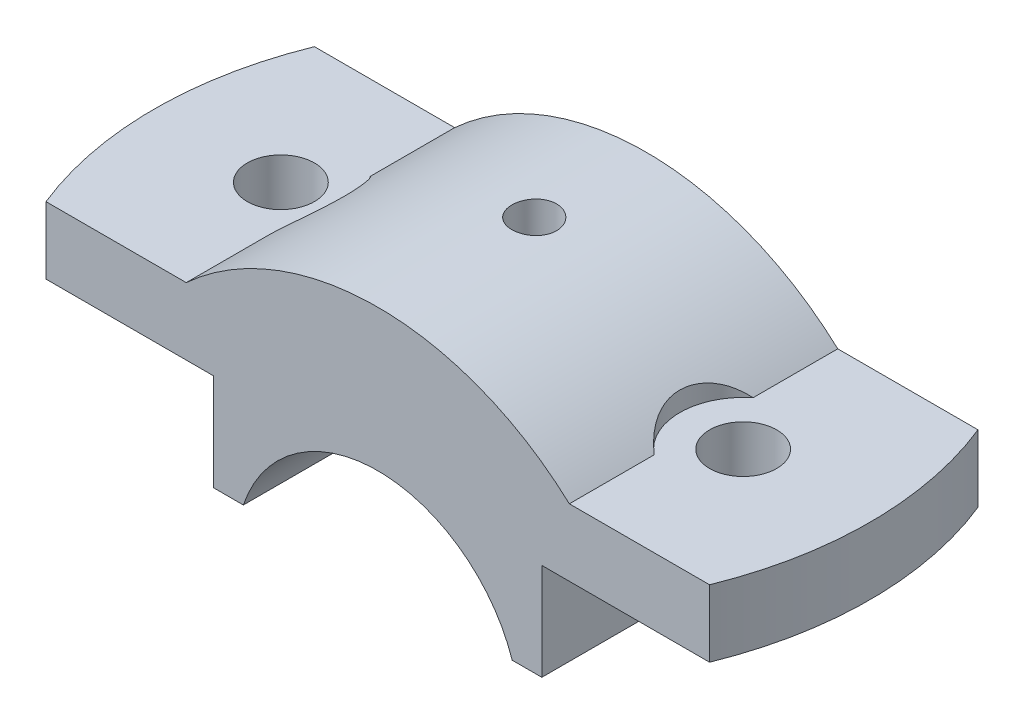
ISO-10303-21;
HEADER;
FILE_DESCRIPTION(('STEP AP214'),'2;1');
FILE_NAME('part.step','',(''),(''),'','','');
FILE_SCHEMA(('AUTOMOTIVE_DESIGN { 1 0 10303 214 1 1 1 1 }'));
ENDSEC;
DATA;
#1=APPLICATION_CONTEXT('core data for automotive mechanical design processes');
#2=APPLICATION_PROTOCOL_DEFINITION('international standard','automotive_design',2000,#1);
#3=PRODUCT_CONTEXT('',#1,'mechanical');
#4=PRODUCT('Part','Part','',(#3));
#5=PRODUCT_RELATED_PRODUCT_CATEGORY('part','',(#4));
#6=PRODUCT_DEFINITION_FORMATION('','',#4);
#7=PRODUCT_DEFINITION_CONTEXT('part definition',#1,'design');
#8=PRODUCT_DEFINITION('design','',#6,#7);
#9=PRODUCT_DEFINITION_SHAPE('','',#8);
#10=(LENGTH_UNIT() NAMED_UNIT(*) SI_UNIT(.MILLI.,.METRE.));
#11=(NAMED_UNIT(*) PLANE_ANGLE_UNIT() SI_UNIT($,.RADIAN.));
#12=(NAMED_UNIT(*) SI_UNIT($,.STERADIAN.) SOLID_ANGLE_UNIT());
#13=UNCERTAINTY_MEASURE_WITH_UNIT(LENGTH_MEASURE(1.E-05),#10,'distance_accuracy_value','');
#14=(GEOMETRIC_REPRESENTATION_CONTEXT(3) GLOBAL_UNCERTAINTY_ASSIGNED_CONTEXT((#13)) GLOBAL_UNIT_ASSIGNED_CONTEXT((#10,
#11,#12)) REPRESENTATION_CONTEXT('',''));
#15=CARTESIAN_POINT('',(0.,0.,0.));
#16=DIRECTION('',(0.,0.,1.));
#17=DIRECTION('',(1.,0.,0.));
#18=AXIS2_PLACEMENT_3D('',#15,#16,#17);
#19=CARTESIAN_POINT('',(22.,19.,18.));
#20=DIRECTION('',(0.,1.,0.));
#21=DIRECTION('',(0.,0.,1.));
#22=AXIS2_PLACEMENT_3D('',#19,#20,#21);
#23=PLANE('',#22);
#24=CARTESIAN_POINT('',(31.,19.,0.));
#25=DIRECTION('',(0.,1.,0.));
#26=DIRECTION('',(0.,0.,1.));
#27=AXIS2_PLACEMENT_3D('',#24,#25,#26);
#28=CIRCLE('',#27,4.49999999999999);
#29=CARTESIAN_POINT('',(31.,19.,4.49999999999999));
#30=VERTEX_POINT('',#29);
#31=EDGE_CURVE('E487',#30,#30,#28,.T.);
#32=ORIENTED_EDGE('',*,*,#31,.T.);
#33=EDGE_LOOP('',(#32));
#34=FACE_BOUND('',#33,.T.);
#35=CARTESIAN_POINT('',(0.,19.,0.));
#36=DIRECTION('',(0.,1.,0.));
#37=DIRECTION('',(0.,0.,1.));
#38=AXIS2_PLACEMENT_3D('',#35,#36,#37);
#39=CIRCLE('',#38,48.);
#40=CARTESIAN_POINT('',(44.497190922574,19.,18.));
#41=VERTEX_POINT('',#40);
#42=CARTESIAN_POINT('',(44.497190922574,19.,-18.));
#43=VERTEX_POINT('',#42);
#44=EDGE_CURVE('E61',#41,#43,#39,.T.);
#45=ORIENTED_EDGE('',*,*,#44,.F.);
#46=DIRECTION('',(1.,0.,0.));
#47=VECTOR('',#46,1.);
#48=CARTESIAN_POINT('',(22.,19.,18.));
#49=LINE('',#48,#47);
#50=CARTESIAN_POINT('',(22.,19.,18.));
#51=VERTEX_POINT('',#50);
#52=EDGE_CURVE('E310',#51,#41,#49,.T.);
#53=ORIENTED_EDGE('',*,*,#52,.F.);
#54=DIRECTION('',(0.,0.,-1.));
#55=VECTOR('',#54,1.);
#56=CARTESIAN_POINT('',(22.,19.,18.));
#57=LINE('',#56,#55);
#58=CARTESIAN_POINT('',(22.,19.,-18.));
#59=VERTEX_POINT('',#58);
#60=EDGE_CURVE('E156',#51,#59,#57,.T.);
#61=ORIENTED_EDGE('',*,*,#60,.T.);
#62=DIRECTION('',(1.,0.,0.));
#63=VECTOR('',#62,1.);
#64=CARTESIAN_POINT('',(22.,19.,-18.));
#65=LINE('',#64,#63);
#66=EDGE_CURVE('E254',#59,#43,#65,.T.);
#67=ORIENTED_EDGE('',*,*,#66,.T.);
#68=EDGE_LOOP('',(#45,#53,#61,#67));
#69=FACE_BOUND('',#68,.T.);
#70=ADVANCED_FACE('F32',(#34,#69),#23,.F.);
#71=CARTESIAN_POINT('',(50.,28.,18.));
#72=DIRECTION('',(0.,-1.,0.));
#73=DIRECTION('',(1.,0.,0.));
#74=AXIS2_PLACEMENT_3D('',#71,#72,#73);
#75=PLANE('',#74);
#76=CARTESIAN_POINT('',(31.,28.,0.));
#77=DIRECTION('',(0.,1.,0.));
#78=DIRECTION('',(0.,0.,1.));
#79=AXIS2_PLACEMENT_3D('',#76,#77,#78);
#80=CIRCLE('',#79,4.49999999999999);
#81=CARTESIAN_POINT('',(31.,28.,4.49999999999999));
#82=VERTEX_POINT('',#81);
#83=EDGE_CURVE('E140',#82,#82,#80,.T.);
#84=ORIENTED_EDGE('',*,*,#83,.F.);
#85=EDGE_LOOP('',(#84));
#86=FACE_BOUND('',#85,.T.);
#87=CARTESIAN_POINT('',(0.,28.,0.));
#88=DIRECTION('',(0.,1.,0.));
#89=DIRECTION('',(1.,0.,0.));
#90=AXIS2_PLACEMENT_3D('',#87,#88,#89);
#91=CIRCLE('',#90,48.);
#92=CARTESIAN_POINT('',(44.497190922574,28.,18.));
#93=VERTEX_POINT('',#92);
#94=CARTESIAN_POINT('',(44.497190922574,28.,-18.));
#95=VERTEX_POINT('',#94);
#96=EDGE_CURVE('E488',#93,#95,#91,.T.);
#97=ORIENTED_EDGE('',*,*,#96,.T.);
#98=DIRECTION('',(-1.,0.,0.));
#99=VECTOR('',#98,1.);
#100=CARTESIAN_POINT('',(50.,28.,-18.));
#101=LINE('',#100,#99);
#102=CARTESIAN_POINT('',(25.6904651573303,28.,-18.));
#103=VERTEX_POINT('',#102);
#104=EDGE_CURVE('E152',#95,#103,#101,.T.);
#105=ORIENTED_EDGE('',*,*,#104,.T.);
#106=DIRECTION('',(0.,0.,-1.));
#107=VECTOR('',#106,1.);
#108=CARTESIAN_POINT('',(25.6904651573303,28.,18.));
#109=LINE('',#108,#107);
#110=CARTESIAN_POINT('',(25.6904651573303,28.,-6.63768331230679));
#111=VERTEX_POINT('',#110);
#112=EDGE_CURVE('E145',#111,#103,#109,.T.);
#113=ORIENTED_EDGE('',*,*,#112,.F.);
#114=CARTESIAN_POINT('',(31.,28.,0.));
#115=DIRECTION('',(0.,-1.,0.));
#116=DIRECTION('',(1.,0.,0.));
#117=AXIS2_PLACEMENT_3D('',#114,#115,#116);
#118=CIRCLE('',#117,8.5);
#119=CARTESIAN_POINT('',(25.6904651573303,28.,6.63768331230678));
#120=VERTEX_POINT('',#119);
#121=EDGE_CURVE('E53',#120,#111,#118,.T.);
#122=ORIENTED_EDGE('',*,*,#121,.F.);
#123=CARTESIAN_POINT('',(25.6904651573303,28.,18.));
#124=VERTEX_POINT('',#123);
#125=EDGE_CURVE('E148',#124,#120,#109,.T.);
#126=ORIENTED_EDGE('',*,*,#125,.F.);
#127=DIRECTION('',(-1.,0.,0.));
#128=VECTOR('',#127,1.);
#129=CARTESIAN_POINT('',(50.,28.,18.));
#130=LINE('',#129,#128);
#131=EDGE_CURVE('E313',#93,#124,#130,.T.);
#132=ORIENTED_EDGE('',*,*,#131,.F.);
#133=EDGE_LOOP('',(#97,#105,#113,#122,#126,#132));
#134=FACE_BOUND('',#133,.T.);
#135=ADVANCED_FACE('F150',(#86,#134),#75,.F.);
#136=CARTESIAN_POINT('',(0.,0.,18.));
#137=DIRECTION('',(0.,0.,1.));
#138=DIRECTION('',(1.,0.,0.));
#139=AXIS2_PLACEMENT_3D('',#136,#137,#138);
#140=PLANE('',#139);
#141=ORIENTED_EDGE('',*,*,#52,.T.);
#142=DIRECTION('',(0.,1.,0.));
#143=VECTOR('',#142,1.);
#144=CARTESIAN_POINT('',(44.497190922574,5.99999999999998,18.));
#145=LINE('',#144,#143);
#146=EDGE_CURVE('E490',#41,#93,#145,.T.);
#147=ORIENTED_EDGE('',*,*,#146,.T.);
#148=ORIENTED_EDGE('',*,*,#131,.T.);
#149=CARTESIAN_POINT('',(0.,0.,18.));
#150=DIRECTION('',(0.,0.,1.));
#151=DIRECTION('',(1.,0.,0.));
#152=AXIS2_PLACEMENT_3D('',#149,#150,#151);
#153=CIRCLE('',#152,38.);
#154=CARTESIAN_POINT('',(-25.6904651573303,28.,18.));
#155=VERTEX_POINT('',#154);
#156=EDGE_CURVE('E315',#124,#155,#153,.T.);
#157=ORIENTED_EDGE('',*,*,#156,.T.);
#158=DIRECTION('',(-1.,0.,0.));
#159=VECTOR('',#158,1.);
#160=CARTESIAN_POINT('',(-50.,28.,18.));
#161=LINE('',#160,#159);
#162=CARTESIAN_POINT('',(-44.497190922574,28.,18.));
#163=VERTEX_POINT('',#162);
#164=EDGE_CURVE('E317',#155,#163,#161,.T.);
#165=ORIENTED_EDGE('',*,*,#164,.T.);
#166=DIRECTION('',(0.,1.,0.));
#167=VECTOR('',#166,1.);
#168=CARTESIAN_POINT('',(-44.497190922574,5.99999999999998,18.));
#169=LINE('',#168,#167);
#170=CARTESIAN_POINT('',(-44.497190922574,19.,18.));
#171=VERTEX_POINT('',#170);
#172=EDGE_CURVE('E300',#171,#163,#169,.T.);
#173=ORIENTED_EDGE('',*,*,#172,.F.);
#174=DIRECTION('',(1.,0.,0.));
#175=VECTOR('',#174,1.);
#176=CARTESIAN_POINT('',(-22.,19.,18.));
#177=LINE('',#176,#175);
#178=CARTESIAN_POINT('',(-22.,19.,18.));
#179=VERTEX_POINT('',#178);
#180=EDGE_CURVE('E299',#171,#179,#177,.T.);
#181=ORIENTED_EDGE('',*,*,#180,.T.);
#182=DIRECTION('',(0.,-1.,0.));
#183=VECTOR('',#182,1.);
#184=CARTESIAN_POINT('',(-22.,6.,18.));
#185=LINE('',#184,#183);
#186=CARTESIAN_POINT('',(-22.,6.,18.));
#187=VERTEX_POINT('',#186);
#188=EDGE_CURVE('E321',#179,#187,#185,.T.);
#189=ORIENTED_EDGE('',*,*,#188,.T.);
#190=DIRECTION('',(1.,0.,0.));
#191=VECTOR('',#190,1.);
#192=CARTESIAN_POINT('',(-18.0277563773199,6.,18.));
#193=LINE('',#192,#191);
#194=CARTESIAN_POINT('',(-18.0277563773199,6.,18.));
#195=VERTEX_POINT('',#194);
#196=EDGE_CURVE('E276',#187,#195,#193,.T.);
#197=ORIENTED_EDGE('',*,*,#196,.T.);
#198=CARTESIAN_POINT('',(0.,0.,18.));
#199=DIRECTION('',(0.,0.,-1.));
#200=DIRECTION('',(1.,0.,0.));
#201=AXIS2_PLACEMENT_3D('',#198,#199,#200);
#202=CIRCLE('',#201,19.);
#203=CARTESIAN_POINT('',(18.0277563773199,6.,18.));
#204=VERTEX_POINT('',#203);
#205=EDGE_CURVE('E271',#195,#204,#202,.T.);
#206=ORIENTED_EDGE('',*,*,#205,.T.);
#207=DIRECTION('',(1.,0.,0.));
#208=VECTOR('',#207,1.);
#209=CARTESIAN_POINT('',(18.0277563773199,6.,18.));
#210=LINE('',#209,#208);
#211=CARTESIAN_POINT('',(22.,6.,18.));
#212=VERTEX_POINT('',#211);
#213=EDGE_CURVE('E307',#204,#212,#210,.T.);
#214=ORIENTED_EDGE('',*,*,#213,.T.);
#215=DIRECTION('',(0.,1.,0.));
#216=VECTOR('',#215,1.);
#217=CARTESIAN_POINT('',(22.,6.,18.));
#218=LINE('',#217,#216);
#219=EDGE_CURVE('E251',#212,#51,#218,.T.);
#220=ORIENTED_EDGE('',*,*,#219,.T.);
#221=EDGE_LOOP('',(#141,#147,#148,#157,#165,#173,#181,#189,#197,#206,#214,#220));
#222=FACE_BOUND('',#221,.T.);
#223=ADVANCED_FACE('F224',(#222),#140,.T.);
#224=CARTESIAN_POINT('',(0.,0.,-18.));
#225=DIRECTION('',(0.,0.,1.));
#226=DIRECTION('',(1.,0.,0.));
#227=AXIS2_PLACEMENT_3D('',#224,#225,#226);
#228=PLANE('',#227);
#229=DIRECTION('',(0.,1.,0.));
#230=VECTOR('',#229,1.);
#231=CARTESIAN_POINT('',(44.497190922574,5.99999999999999,-18.));
#232=LINE('',#231,#230);
#233=EDGE_CURVE('E46',#43,#95,#232,.T.);
#234=ORIENTED_EDGE('',*,*,#233,.F.);
#235=ORIENTED_EDGE('',*,*,#66,.F.);
#236=DIRECTION('',(0.,1.,0.));
#237=VECTOR('',#236,1.);
#238=CARTESIAN_POINT('',(22.,6.,-18.));
#239=LINE('',#238,#237);
#240=CARTESIAN_POINT('',(22.,6.,-18.));
#241=VERTEX_POINT('',#240);
#242=EDGE_CURVE('E247',#241,#59,#239,.T.);
#243=ORIENTED_EDGE('',*,*,#242,.F.);
#244=DIRECTION('',(1.,0.,0.));
#245=VECTOR('',#244,1.);
#246=CARTESIAN_POINT('',(18.0277563773199,6.,-18.));
#247=LINE('',#246,#245);
#248=CARTESIAN_POINT('',(18.0277563773199,6.,-18.));
#249=VERTEX_POINT('',#248);
#250=EDGE_CURVE('E240',#249,#241,#247,.T.);
#251=ORIENTED_EDGE('',*,*,#250,.F.);
#252=CARTESIAN_POINT('',(0.,0.,-18.));
#253=DIRECTION('',(0.,0.,-1.));
#254=DIRECTION('',(1.,0.,0.));
#255=AXIS2_PLACEMENT_3D('',#252,#253,#254);
#256=CIRCLE('',#255,19.);
#257=CARTESIAN_POINT('',(-18.0277563773199,6.,-18.));
#258=VERTEX_POINT('',#257);
#259=EDGE_CURVE('E248',#258,#249,#256,.T.);
#260=ORIENTED_EDGE('',*,*,#259,.F.);
#261=DIRECTION('',(1.,0.,0.));
#262=VECTOR('',#261,1.);
#263=CARTESIAN_POINT('',(-18.0277563773199,6.,-18.));
#264=LINE('',#263,#262);
#265=CARTESIAN_POINT('',(-22.,6.,-18.));
#266=VERTEX_POINT('',#265);
#267=EDGE_CURVE('E269',#266,#258,#264,.T.);
#268=ORIENTED_EDGE('',*,*,#267,.F.);
#269=DIRECTION('',(0.,-1.,0.));
#270=VECTOR('',#269,1.);
#271=CARTESIAN_POINT('',(-22.,6.,-18.));
#272=LINE('',#271,#270);
#273=CARTESIAN_POINT('',(-22.,19.,-18.));
#274=VERTEX_POINT('',#273);
#275=EDGE_CURVE('E267',#274,#266,#272,.T.);
#276=ORIENTED_EDGE('',*,*,#275,.F.);
#277=DIRECTION('',(1.,0.,0.));
#278=VECTOR('',#277,1.);
#279=CARTESIAN_POINT('',(-22.,19.,-18.));
#280=LINE('',#279,#278);
#281=CARTESIAN_POINT('',(-44.497190922574,19.,-18.));
#282=VERTEX_POINT('',#281);
#283=EDGE_CURVE('E265',#282,#274,#280,.T.);
#284=ORIENTED_EDGE('',*,*,#283,.F.);
#285=DIRECTION('',(0.,1.,0.));
#286=VECTOR('',#285,1.);
#287=CARTESIAN_POINT('',(-44.497190922574,5.99999999999999,-18.));
#288=LINE('',#287,#286);
#289=CARTESIAN_POINT('',(-44.497190922574,28.,-18.));
#290=VERTEX_POINT('',#289);
#291=EDGE_CURVE('E170',#282,#290,#288,.T.);
#292=ORIENTED_EDGE('',*,*,#291,.T.);
#293=DIRECTION('',(-1.,0.,0.));
#294=VECTOR('',#293,1.);
#295=CARTESIAN_POINT('',(-50.,28.,-18.));
#296=LINE('',#295,#294);
#297=CARTESIAN_POINT('',(-25.6904651573303,28.,-18.));
#298=VERTEX_POINT('',#297);
#299=EDGE_CURVE('E262',#298,#290,#296,.T.);
#300=ORIENTED_EDGE('',*,*,#299,.F.);
#301=CARTESIAN_POINT('',(0.,0.,-18.));
#302=DIRECTION('',(0.,0.,1.));
#303=DIRECTION('',(1.,0.,0.));
#304=AXIS2_PLACEMENT_3D('',#301,#302,#303);
#305=CIRCLE('',#304,38.);
#306=EDGE_CURVE('E260',#103,#298,#305,.T.);
#307=ORIENTED_EDGE('',*,*,#306,.F.);
#308=ORIENTED_EDGE('',*,*,#104,.F.);
#309=EDGE_LOOP('',(#234,#235,#243,#251,#260,#268,#276,#284,#292,#300,#307,#308));
#310=FACE_BOUND('',#309,.T.);
#311=ADVANCED_FACE('F216',(#310),#228,.F.);
#312=CARTESIAN_POINT('',(0.,0.,18.));
#313=DIRECTION('',(0.,0.,-1.));
#314=DIRECTION('',(-1.,0.,0.));
#315=AXIS2_PLACEMENT_3D('',#312,#313,#314);
#316=CYLINDRICAL_SURFACE('',#315,38.);
#317=CARTESIAN_POINT('',(0.,38.,0.0160566441033778));
#318=CARTESIAN_POINT('',(-0.168230277437706,37.9999984430739,0.0160492827868403));
#319=CARTESIAN_POINT('',(-0.336575845655095,37.9988709200709,0.00185834327270103));
#320=CARTESIAN_POINT('',(-0.668611397196742,37.9944814128081,-0.0545444065932844));
#321=CARTESIAN_POINT('',(-0.832295850092009,37.9912169949171,-0.0967881660671856));
#322=CARTESIAN_POINT('',(-1.15015205512757,37.9829226863334,-0.208069292325948));
#323=CARTESIAN_POINT('',(-1.3043290493551,37.9778937789402,-0.27709173837441));
#324=CARTESIAN_POINT('',(-1.59887136159142,37.9666348413683,-0.439944816261156));
#325=CARTESIAN_POINT('',(-1.73923967362019,37.9604050724332,-0.533770053980161));
#326=CARTESIAN_POINT('',(-2.00254103126273,37.9474277075509,-0.743799262623435));
#327=CARTESIAN_POINT('',(-2.12543792166293,37.9406790810774,-0.860048499503117));
#328=CARTESIAN_POINT('',(-2.34999780988339,37.9274332919605,-1.11153053983706));
#329=CARTESIAN_POINT('',(-2.45165988585507,37.9209361402441,-1.24676416701824));
#330=CARTESIAN_POINT('',(-2.63098484586302,37.9089176287414,-1.53259269906815));
#331=CARTESIAN_POINT('',(-2.708616254697,37.903397552738,-1.68320740965947));
#332=CARTESIAN_POINT('',(-2.83747510230931,37.8939696224707,-1.99538450683674));
#333=CARTESIAN_POINT('',(-2.88870296451239,37.8900617423529,-2.15694671781431));
#334=CARTESIAN_POINT('',(-2.96319644645853,37.8843090780475,-2.48607267607698));
#335=CARTESIAN_POINT('',(-2.98652059882487,37.8824599758018,-2.65362309853885));
#336=CARTESIAN_POINT('',(-3.00472536931325,37.8810204867557,-2.9902701730466));
#337=CARTESIAN_POINT('',(-2.99960647157769,37.8814300615093,-3.15936679872492));
#338=CARTESIAN_POINT('',(-2.96111886260011,37.8844577346025,-3.4939056659319));
#339=CARTESIAN_POINT('',(-2.92781369865023,37.8870708648728,-3.65935526960735));
#340=CARTESIAN_POINT('',(-2.83399765916122,37.8942034046858,-3.98230857101988));
#341=CARTESIAN_POINT('',(-2.77348654183749,37.8987228311701,-4.13981219812568));
#342=CARTESIAN_POINT('',(-2.62690490032727,37.9091644380148,-4.44260550561573));
#343=CARTESIAN_POINT('',(-2.54080579129679,37.9150881856644,-4.5878812918954));
#344=CARTESIAN_POINT('',(-2.34551283184452,37.9276694800349,-4.86194314380706));
#345=CARTESIAN_POINT('',(-2.23631856235736,37.9343270400699,-4.99072891015691));
#346=CARTESIAN_POINT('',(-1.99757813910437,37.947647885739,-5.22852451485718));
#347=CARTESIAN_POINT('',(-1.86797703439473,37.9543111370687,-5.33747919348295));
#348=CARTESIAN_POINT('',(-1.59229376436976,37.9668751419437,-5.53209355468779));
#349=CARTESIAN_POINT('',(-1.44621158946688,37.9727758950454,-5.61775322371533));
#350=CARTESIAN_POINT('',(-1.14167761997914,37.983150993084,-5.76334228136688));
#351=CARTESIAN_POINT('',(-0.983224692335489,37.9876252071703,-5.82326930981837));
#352=CARTESIAN_POINT('',(-0.658463212690178,37.9946415451888,-5.91565377532564));
#353=CARTESIAN_POINT('',(-0.492154807064347,37.997183705107,-5.94811172401624));
#354=CARTESIAN_POINT('',(-0.156881478742686,38.0000448768352,-5.98456770030342));
#355=CARTESIAN_POINT('',(0.0120751089608361,38.0003698415183,-5.98864193500144));
#356=CARTESIAN_POINT('',(0.348269003373996,37.9987758913175,-5.96841434533064));
#357=CARTESIAN_POINT('',(0.515506324442481,37.9968569951891,-5.9441127581435));
#358=CARTESIAN_POINT('',(0.843297753735753,37.9909950041868,-5.8678865056925));
#359=CARTESIAN_POINT('',(1.00386010671882,37.987054491835,-5.81599707956694));
#360=CARTESIAN_POINT('',(1.31399900365978,37.9775920824189,-5.68610404300444));
#361=CARTESIAN_POINT('',(1.46357539119334,37.972070162843,-5.60810006082167));
#362=CARTESIAN_POINT('',(1.74784375041781,37.9600494395666,-5.42800006629791));
#363=CARTESIAN_POINT('',(1.88250358772923,37.953548595394,-5.32585347159407));
#364=CARTESIAN_POINT('',(2.13279217984117,37.9403075453845,-5.10044101640771));
#365=CARTESIAN_POINT('',(2.24842063776818,37.9335673358158,-4.97717482653849));
#366=CARTESIAN_POINT('',(2.4576248497514,37.9205896766453,-4.71269200424827));
#367=CARTESIAN_POINT('',(2.55115094155127,37.9143533795852,-4.57143602494341));
#368=CARTESIAN_POINT('',(2.713155238272,37.9031055627809,-4.27517965031409));
#369=CARTESIAN_POINT('',(2.78163367119924,37.8980940318878,-4.12017938011851));
#370=CARTESIAN_POINT('',(2.89151387110068,37.8898693720601,-3.80101145568379));
#371=CARTESIAN_POINT('',(2.93294623887224,37.8866542112497,-3.63685439089556));
#372=CARTESIAN_POINT('',(2.98765790023766,37.8823793491511,-3.30388720626979));
#373=CARTESIAN_POINT('',(3.00093767292138,37.8813196111828,-3.13507716566429));
#374=CARTESIAN_POINT('',(2.99896188688675,37.8814760426207,-2.7980894969537));
#375=CARTESIAN_POINT('',(2.98378436644711,37.8826859878913,-2.62991140289502));
#376=CARTESIAN_POINT('',(2.92548733876923,37.887232237977,-2.29850048287751));
#377=CARTESIAN_POINT('',(2.8823677867555,37.8905685461995,-2.13526766484363));
#378=CARTESIAN_POINT('',(2.7694300101543,37.8989899804525,-1.81837435902651));
#379=CARTESIAN_POINT('',(2.69961296444521,37.9040750292632,-1.66471344892591));
#380=CARTESIAN_POINT('',(2.535271096382,37.9154210711218,-1.37128157494776));
#381=CARTESIAN_POINT('',(2.44074672054794,37.9216820429175,-1.23151036011346));
#382=CARTESIAN_POINT('',(2.22938062382269,37.9346948182221,-0.969426553012625));
#383=CARTESIAN_POINT('',(2.11248130954251,37.941447859921,-0.847160470742295));
#384=CARTESIAN_POINT('',(1.85978424897896,37.954672635902,-0.623937794592456));
#385=CARTESIAN_POINT('',(1.72398192526551,37.9611443015481,-0.52298637708104));
#386=CARTESIAN_POINT('',(1.43709756450133,37.9730876131211,-0.345137930221112));
#387=CARTESIAN_POINT('',(1.2859897583193,37.978557527474,-0.268282391523685));
#388=CARTESIAN_POINT('',(0.973076064569828,37.9878601967286,-0.141131353997113));
#389=CARTESIAN_POINT('',(0.811282773093929,37.9916948408735,-0.0908051895641004));
#390=CARTESIAN_POINT('',(0.540438770546245,37.9963056825779,-0.0310203901762838));
#391=CARTESIAN_POINT('',(0.433132098217289,37.9976847801056,-0.0133898167263432));
#392=CARTESIAN_POINT('',(0.21723297545625,37.9995324404705,0.0101510636097905));
#393=CARTESIAN_POINT('',(0.108640528034263,38.0000010054389,0.016061397928479));
#394=CARTESIAN_POINT('',(0.,38.,0.0160566441033778));
#395=B_SPLINE_CURVE_WITH_KNOTS('',3,(#317,#318,#319,#320,#321,#322,#323,#324,#325,#326,#327,
#328,#329,#330,#331,#332,#333,#334,#335,#336,#337,#338,#339,#340,#341,#342,#343,#344,#345,#346,
#347,#348,#349,#350,#351,#352,#353,#354,#355,#356,#357,#358,#359,#360,#361,#362,#363,#364,#365,
#366,#367,#368,#369,#370,#371,#372,#373,#374,#375,#376,#377,#378,#379,#380,#381,#382,#383,#384,
#385,#386,#387,#388,#389,#390,#391,#392,#393,#394),.UNSPECIFIED.,.T.,.F.,(4,2,2,2,2,2,2,2,2,2,2,
2,2,2,2,2,2,2,2,2,2,2,2,2,2,2,2,2,2,2,2,2,2,2,2,2,2,2,4),(0.,0.504294188546741,1.00916370078726,
1.51375230936014,2.01823126998903,2.52373945491489,3.02926958047039,3.53545907123702,
4.04164044416132,4.54675814609821,5.05186725021795,5.55584058602808,6.05981840083593,
6.56436134901272,7.06891345298728,7.57484819748388,8.08078323629979,8.58676466907349,
9.09273667730811,9.5973496818578,10.1019584685879,10.6059242398502,11.1098971854695,
11.614935538604,12.1199817691652,12.6261522324058,13.1323180879118,13.6379102536977,
14.1434938154447,14.6476929456065,15.1518928837201,15.6560705605014,16.1602391262259,
16.6657233184336,17.1713301290485,17.6778028214877,18.183688785524,18.5093549854356,
18.8350204230892),.UNSPECIFIED.);
#396=CARTESIAN_POINT('',(0.,38.,0.0160566441033778));
#397=VERTEX_POINT('',#396);
#398=EDGE_CURVE('E173',#397,#397,#395,.T.);
#399=ORIENTED_EDGE('',*,*,#398,.T.);
#400=EDGE_LOOP('',(#399));
#401=FACE_BOUND('',#400,.T.);
#402=ORIENTED_EDGE('',*,*,#125,.T.);
#403=CARTESIAN_POINT('',(25.6904651573303,28.,6.63768331230679));
#404=CARTESIAN_POINT('',(25.5360851043424,28.1416681018721,6.51420867249736));
#405=CARTESIAN_POINT('',(25.3836215551735,28.2791823336498,6.38340380017067));
#406=CARTESIAN_POINT('',(25.0841053598261,28.5451833866574,6.10685950724569));
#407=CARTESIAN_POINT('',(24.9370580895264,28.6736613482156,5.96110576476092));
#408=CARTESIAN_POINT('',(24.6491941230388,28.9215085426633,5.65349144226199));
#409=CARTESIAN_POINT('',(24.508431723833,29.0408031542341,5.49151942353938));
#410=CARTESIAN_POINT('',(24.2363075607749,29.2682904084011,5.15263687836668));
#411=CARTESIAN_POINT('',(24.1049430857226,29.3764862568107,4.97573069263071));
#412=CARTESIAN_POINT('',(23.8528205053459,29.5815743674557,4.60631493821572));
#413=CARTESIAN_POINT('',(23.7321338833277,29.6783916917415,4.41371469093334));
#414=CARTESIAN_POINT('',(23.5043908446779,29.85908164754,4.01479632179464));
#415=CARTESIAN_POINT('',(23.3973358972541,29.942952883943,3.80847672492269));
#416=CARTESIAN_POINT('',(23.1992536300817,30.0966827286364,3.38422419101504));
#417=CARTESIAN_POINT('',(23.1081729651954,30.1665880882949,3.1663331999127));
#418=CARTESIAN_POINT('',(22.9434688496595,30.2920447623401,2.72008092153074));
#419=CARTESIAN_POINT('',(22.869842066784,30.347598816803,2.49172164276593));
#420=CARTESIAN_POINT('',(22.7499342032063,30.4375648556656,2.05682098381956));
#421=CARTESIAN_POINT('',(22.7013462567531,30.4737833576563,1.85128534823191));
#422=CARTESIAN_POINT('',(22.6194172898017,30.534645499234,1.43551725204115));
#423=CARTESIAN_POINT('',(22.5860747992536,30.5592902548309,1.2252852463389));
#424=CARTESIAN_POINT('',(22.5352129551669,30.5968164834569,0.801799591498527));
#425=CARTESIAN_POINT('',(22.5176992505084,30.6096937569973,0.588544891193921));
#426=CARTESIAN_POINT('',(22.4988301660851,30.6235658271181,0.160939560666234));
#427=CARTESIAN_POINT('',(22.4974739036633,30.624561272785,-0.0534110090511328));
#428=CARTESIAN_POINT('',(22.5103301119086,30.6151119876343,-0.461997479818149));
#429=CARTESIAN_POINT('',(22.5231488228924,30.6056914251709,-0.656303160135775));
#430=CARTESIAN_POINT('',(22.5619809221014,30.5770763766543,-1.04286259298841));
#431=CARTESIAN_POINT('',(22.5879939672906,30.5578821447042,-1.23511639873688));
#432=CARTESIAN_POINT('',(22.6528192304938,30.5098574663833,-1.61613906729809));
#433=CARTESIAN_POINT('',(22.6916259266854,30.4810311771979,-1.80490939654949));
#434=CARTESIAN_POINT('',(22.7814851533843,30.4139289484325,-2.17779604427594));
#435=CARTESIAN_POINT('',(22.8325379785097,30.3756527815061,-2.36191225066403));
#436=CARTESIAN_POINT('',(22.9463727274414,30.2897519777021,-2.72495933677603));
#437=CARTESIAN_POINT('',(23.0091940590921,30.2420959034169,-2.90387039063447));
#438=CARTESIAN_POINT('',(23.1456283742011,30.1378044455698,-3.2548914886335));
#439=CARTESIAN_POINT('',(23.2192449894415,30.0811660396201,-3.4269992191435));
#440=CARTESIAN_POINT('',(23.3763137314078,29.9592695660632,-3.76349373210637));
#441=CARTESIAN_POINT('',(23.4597660818508,29.8940113023904,-3.92788033882066));
#442=CARTESIAN_POINT('',(23.635527045378,29.7552415450916,-4.24828704232643));
#443=CARTESIAN_POINT('',(23.7278387953854,29.6817271265587,-4.40430414494656));
#444=CARTESIAN_POINT('',(23.9282386479047,29.5204551498758,-4.71995510834892));
#445=CARTESIAN_POINT('',(24.0370002176616,29.432022004933,-4.87881602386906));
#446=CARTESIAN_POINT('',(24.2623844714665,29.2465042091278,-5.1856332961988));
#447=CARTESIAN_POINT('',(24.379010630913,29.1494157272481,-5.33358477081362));
#448=CARTESIAN_POINT('',(24.6187042069683,28.9472618083659,-5.61815393006346));
#449=CARTESIAN_POINT('',(24.7417672458198,28.8422017715012,-5.75477915839728));
#450=CARTESIAN_POINT('',(24.9931857635632,28.6246099475779,-6.01673825944901));
#451=CARTESIAN_POINT('',(25.121541230047,28.5120781780363,-6.14207215863705));
#452=CARTESIAN_POINT('',(25.3239635142993,28.3320696328102,-6.32788833390874));
#453=CARTESIAN_POINT('',(25.3966039536003,28.2669811541268,-6.39227987552885));
#454=CARTESIAN_POINT('',(25.5428336292653,28.1349133065772,-6.5175597465675));
#455=CARTESIAN_POINT('',(25.6164208573994,28.0679376662269,-6.57845434819235));
#456=CARTESIAN_POINT('',(25.6904651573302,28.0000000000002,-6.63768331230705));
#457=B_SPLINE_CURVE_WITH_KNOTS('',3,(#403,#404,#405,#406,#407,#408,#409,#410,#411,#412,#413,
#414,#415,#416,#417,#418,#419,#420,#421,#422,#423,#424,#425,#426,#427,#428,#429,#430,#431,#432,
#433,#434,#435,#436,#437,#438,#439,#440,#441,#442,#443,#444,#445,#446,#447,#448,#449,#450,#451,
#452,#453,#454,#455,#456),.UNSPECIFIED.,.F.,.F.,(4,2,2,2,2,2,2,2,2,2,2,2,2,2,2,2,2,2,2,2,2,2,2,
2,2,2,4),(0.,0.729592400834075,1.45989044138352,2.19560470883999,2.93110586753775,
3.67120763552797,4.41138910352642,5.14904966030396,5.88656927223679,6.52855006409984,
7.17046893961488,7.8126168088522,8.45472959834445,9.03890309081731,9.62306139629813,
10.2069679046447,10.7908884620571,11.3768004587137,11.9629100238154,12.549032922753,
13.1353641263273,13.7703169673958,14.4055522594533,15.040361004022,15.6751682603777,
16.0257258218313,16.3756336015193),.UNSPECIFIED.);
#458=EDGE_CURVE('E11',#120,#111,#457,.T.);
#459=ORIENTED_EDGE('',*,*,#458,.T.);
#460=ORIENTED_EDGE('',*,*,#112,.T.);
#461=ORIENTED_EDGE('',*,*,#306,.T.);
#462=DIRECTION('',(0.,0.,-1.));
#463=VECTOR('',#462,1.);
#464=CARTESIAN_POINT('',(-25.6904651573303,28.,18.));
#465=LINE('',#464,#463);
#466=CARTESIAN_POINT('',(-25.6904651573303,28.,-6.63768331230678));
#467=VERTEX_POINT('',#466);
#468=EDGE_CURVE('E158',#467,#298,#465,.T.);
#469=ORIENTED_EDGE('',*,*,#468,.F.);
#470=CARTESIAN_POINT('',(-25.6904651573303,28.,6.63768331230679));
#471=CARTESIAN_POINT('',(-25.5360851043424,28.1416681018721,6.51420867249736));
#472=CARTESIAN_POINT('',(-25.3836215551735,28.2791823336498,6.38340380017067));
#473=CARTESIAN_POINT('',(-25.0841053598261,28.5451833866574,6.10685950724569));
#474=CARTESIAN_POINT('',(-24.9370580895264,28.6736613482156,5.96110576476092));
#475=CARTESIAN_POINT('',(-24.6491941230388,28.9215085426633,5.65349144226199));
#476=CARTESIAN_POINT('',(-24.508431723833,29.0408031542341,5.49151942353938));
#477=CARTESIAN_POINT('',(-24.2363075607749,29.2682904084011,5.15263687836668));
#478=CARTESIAN_POINT('',(-24.1049430857226,29.3764862568107,4.97573069263071));
#479=CARTESIAN_POINT('',(-23.8528205053459,29.5815743674557,4.60631493821572));
#480=CARTESIAN_POINT('',(-23.7321338833277,29.6783916917415,4.41371469093334));
#481=CARTESIAN_POINT('',(-23.5043908446779,29.85908164754,4.01479632179464));
#482=CARTESIAN_POINT('',(-23.3973358972541,29.942952883943,3.80847672492269));
#483=CARTESIAN_POINT('',(-23.1992536300817,30.0966827286364,3.38422419101504));
#484=CARTESIAN_POINT('',(-23.1081729651954,30.1665880882949,3.1663331999127));
#485=CARTESIAN_POINT('',(-22.9434688496595,30.2920447623401,2.72008092153074));
#486=CARTESIAN_POINT('',(-22.869842066784,30.347598816803,2.49172164276593));
#487=CARTESIAN_POINT('',(-22.7499342032063,30.4375648556656,2.05682098381956));
#488=CARTESIAN_POINT('',(-22.7013462567531,30.4737833576563,1.85128534823191));
#489=CARTESIAN_POINT('',(-22.6194172898017,30.534645499234,1.43551725204115));
#490=CARTESIAN_POINT('',(-22.5860747992536,30.5592902548309,1.2252852463389));
#491=CARTESIAN_POINT('',(-22.5352129551669,30.5968164834569,0.801799591498527));
#492=CARTESIAN_POINT('',(-22.5176992505084,30.6096937569973,0.588544891193921));
#493=CARTESIAN_POINT('',(-22.4988301660851,30.6235658271181,0.160939560666234));
#494=CARTESIAN_POINT('',(-22.4974739036633,30.624561272785,-0.0534110090511328));
#495=CARTESIAN_POINT('',(-22.5103301119086,30.6151119876343,-0.461997479818149));
#496=CARTESIAN_POINT('',(-22.5231488228924,30.6056914251709,-0.656303160135775));
#497=CARTESIAN_POINT('',(-22.5619809221014,30.5770763766543,-1.04286259298841));
#498=CARTESIAN_POINT('',(-22.5879939672906,30.5578821447042,-1.23511639873688));
#499=CARTESIAN_POINT('',(-22.6528192304938,30.5098574663833,-1.61613906729809));
#500=CARTESIAN_POINT('',(-22.6916259266854,30.4810311771979,-1.80490939654949));
#501=CARTESIAN_POINT('',(-22.7814851533843,30.4139289484325,-2.17779604427594));
#502=CARTESIAN_POINT('',(-22.8325379785097,30.3756527815061,-2.36191225066403));
#503=CARTESIAN_POINT('',(-22.9463727274414,30.2897519777021,-2.72495933677603));
#504=CARTESIAN_POINT('',(-23.0091940590921,30.2420959034169,-2.90387039063447));
#505=CARTESIAN_POINT('',(-23.1456283742011,30.1378044455698,-3.2548914886335));
#506=CARTESIAN_POINT('',(-23.2192449894415,30.0811660396201,-3.4269992191435));
#507=CARTESIAN_POINT('',(-23.3763137314078,29.9592695660632,-3.76349373210637));
#508=CARTESIAN_POINT('',(-23.4597660818508,29.8940113023904,-3.92788033882066));
#509=CARTESIAN_POINT('',(-23.635527045378,29.7552415450916,-4.24828704232643));
#510=CARTESIAN_POINT('',(-23.7278387953854,29.6817271265587,-4.40430414494656));
#511=CARTESIAN_POINT('',(-23.9282386479047,29.5204551498758,-4.71995510834892));
#512=CARTESIAN_POINT('',(-24.0370002176616,29.432022004933,-4.87881602386906));
#513=CARTESIAN_POINT('',(-24.2623844714665,29.2465042091278,-5.1856332961988));
#514=CARTESIAN_POINT('',(-24.379010630913,29.1494157272481,-5.33358477081362));
#515=CARTESIAN_POINT('',(-24.6187042069683,28.9472618083659,-5.61815393006346));
#516=CARTESIAN_POINT('',(-24.7417672458198,28.8422017715012,-5.75477915839728));
#517=CARTESIAN_POINT('',(-24.9931857635632,28.6246099475779,-6.01673825944901));
#518=CARTESIAN_POINT('',(-25.121541230047,28.5120781780363,-6.14207215863705));
#519=CARTESIAN_POINT('',(-25.3239635142993,28.3320696328102,-6.32788833390874));
#520=CARTESIAN_POINT('',(-25.3966039536003,28.2669811541268,-6.39227987552885));
#521=CARTESIAN_POINT('',(-25.5428336292653,28.1349133065772,-6.5175597465675));
#522=CARTESIAN_POINT('',(-25.6164208573994,28.0679376662269,-6.57845434819235));
#523=CARTESIAN_POINT('',(-25.6904651573302,28.0000000000002,-6.63768331230705));
#524=B_SPLINE_CURVE_WITH_KNOTS('',3,(#470,#471,#472,#473,#474,#475,#476,#477,#478,#479,#480,
#481,#482,#483,#484,#485,#486,#487,#488,#489,#490,#491,#492,#493,#494,#495,#496,#497,#498,#499,
#500,#501,#502,#503,#504,#505,#506,#507,#508,#509,#510,#511,#512,#513,#514,#515,#516,#517,#518,
#519,#520,#521,#522,#523),.UNSPECIFIED.,.F.,.F.,(4,2,2,2,2,2,2,2,2,2,2,2,2,2,2,2,2,2,2,2,2,2,2,
2,2,2,4),(0.,0.729592400834075,1.45989044138352,2.19560470883999,2.93110586753775,
3.67120763552797,4.41138910352642,5.14904966030396,5.88656927223679,6.52855006409984,
7.17046893961488,7.8126168088522,8.45472959834445,9.03890309081731,9.62306139629813,
10.2069679046447,10.7908884620571,11.3768004587137,11.9629100238154,12.549032922753,
13.1353641263273,13.7703169673958,14.4055522594533,15.040361004022,15.6751682603777,
16.0257258218313,16.3756336015193),.UNSPECIFIED.);
#525=CARTESIAN_POINT('',(-25.6904651573303,28.,6.63768331230679));
#526=VERTEX_POINT('',#525);
#527=EDGE_CURVE('E202',#526,#467,#524,.T.);
#528=ORIENTED_EDGE('',*,*,#527,.F.);
#529=EDGE_CURVE('E154',#155,#526,#465,.T.);
#530=ORIENTED_EDGE('',*,*,#529,.F.);
#531=ORIENTED_EDGE('',*,*,#156,.F.);
#532=EDGE_LOOP('',(#402,#459,#460,#461,#469,#528,#530,#531));
#533=FACE_BOUND('',#532,.T.);
#534=ADVANCED_FACE('F143',(#401,#533),#316,.T.);
#535=CARTESIAN_POINT('',(0.,0.,18.));
#536=DIRECTION('',(0.,0.,-1.));
#537=DIRECTION('',(-1.,0.,0.));
#538=AXIS2_PLACEMENT_3D('',#535,#536,#537);
#539=CYLINDRICAL_SURFACE('',#538,19.);
#540=CARTESIAN_POINT('',(0.,19.,-0.483943355896624));
#541=CARTESIAN_POINT('',(0.139778315489381,18.999997967774,-0.483949254950549));
#542=CARTESIAN_POINT('',(0.279642447495432,18.9984412683557,-0.495705681138108));
#543=CARTESIAN_POINT('',(0.555474474016763,18.9923810422329,-0.542416351860274));
#544=CARTESIAN_POINT('',(0.691438217949602,18.9878744896332,-0.577394417171102));
#545=CARTESIAN_POINT('',(0.955436642925262,18.9764219373405,-0.669496296835607));
#546=CARTESIAN_POINT('',(1.08347675216936,18.9694776299244,-0.726604751237286));
#547=CARTESIAN_POINT('',(1.32813277832855,18.9539206812215,-0.861311701352474));
#548=CARTESIAN_POINT('',(1.44475055826477,18.9453083126858,-0.938906847960859));
#549=CARTESIAN_POINT('',(1.66398308687909,18.9273173646443,-1.11288797477276));
#550=CARTESIAN_POINT('',(1.76651843289981,18.9179348817316,-1.20937361636957));
#551=CARTESIAN_POINT('',(1.95399133146886,18.8994924119599,-1.41818270856653));
#552=CARTESIAN_POINT('',(2.0389279601093,18.890432442053,-1.53050699015302));
#553=CARTESIAN_POINT('',(2.18909162338547,18.8736225658863,-1.76832545740245));
#554=CARTESIAN_POINT('',(2.254243636291,18.8658776941045,-1.89386739995009));
#555=CARTESIAN_POINT('',(2.36250946256606,18.8526269269547,-2.15423004622777));
#556=CARTESIAN_POINT('',(2.40562420041089,18.8471209376663,-2.28905036045595));
#557=CARTESIAN_POINT('',(2.46834893112872,18.8390089488849,-2.56331558471903));
#558=CARTESIAN_POINT('',(2.48809350572304,18.8363863510935,-2.70272921619011));
#559=CARTESIAN_POINT('',(2.50393399543624,18.8342874081065,-2.98291393444288));
#560=CARTESIAN_POINT('',(2.50003096100306,18.8348109231579,-3.12368496065053));
#561=CARTESIAN_POINT('',(2.46879737750757,18.8389298660036,-3.4016474538411));
#562=CARTESIAN_POINT('',(2.44161547626707,18.8425058020086,-3.53885595383342));
#563=CARTESIAN_POINT('',(2.36482786882149,18.852296258763,-3.80674711865008));
#564=CARTESIAN_POINT('',(2.31522166359116,18.8585108382319,-3.9374296381749));
#565=CARTESIAN_POINT('',(2.19483509097754,18.8729003199956,-4.18901869105264));
#566=CARTESIAN_POINT('',(2.12399053069557,18.8810811502029,-4.30989415490722));
#567=CARTESIAN_POINT('',(1.96318413435717,18.8984768576706,-4.5380972871974));
#568=CARTESIAN_POINT('',(1.87322133002782,18.9076917872934,-4.64542426901023));
#569=CARTESIAN_POINT('',(1.67591027855668,18.9262039286229,-4.84434630681802));
#570=CARTESIAN_POINT('',(1.5684339827901,18.9355012293485,-4.93581439077779));
#571=CARTESIAN_POINT('',(1.33958658891131,18.9530645440151,-5.09943219623716));
#572=CARTESIAN_POINT('',(1.21821545257772,18.9613305551191,-5.17158186459461));
#573=CARTESIAN_POINT('',(0.964922757293814,18.9759058695861,-5.29451644277333));
#574=CARTESIAN_POINT('',(0.832997072631037,18.9822144030351,-5.34529294890787));
#575=CARTESIAN_POINT('',(0.562390331231886,18.9921571388021,-5.42393669933429));
#576=CARTESIAN_POINT('',(0.423709625549347,18.9957914799383,-5.45180513280042));
#577=CARTESIAN_POINT('',(0.144626841595052,18.9999582136113,-5.48367604056433));
#578=CARTESIAN_POINT('',(0.00424505397900282,19.0005133278906,-5.48785333788898));
#579=CARTESIAN_POINT('',(-0.275216665266614,18.9985205333266,-5.47268541324291));
#580=CARTESIAN_POINT('',(-0.414296627611642,18.9959726978817,-5.4533407476698));
#581=CARTESIAN_POINT('',(-0.686687509149987,18.9880744020358,-5.39182329686437));
#582=CARTESIAN_POINT('',(-0.820017679004481,18.9827342327916,-5.34973431695884));
#583=CARTESIAN_POINT('',(-1.07772769061604,18.9698488481686,-5.24401042467328));
#584=CARTESIAN_POINT('',(-1.20210719868892,18.9623035506347,-5.18037470952654));
#585=CARTESIAN_POINT('',(-1.43916303555311,18.9457917882835,-5.03294392108009));
#586=CARTESIAN_POINT('',(-1.55176881159961,18.9368174879556,-4.94903629801025));
#587=CARTESIAN_POINT('',(-1.76136182953435,18.9184749473973,-4.76360212183025));
#588=CARTESIAN_POINT('',(-1.85834838132062,18.9091066897838,-4.66207479064258));
#589=CARTESIAN_POINT('',(-2.03457405133125,18.8909615049602,-4.44351103007243));
#590=CARTESIAN_POINT('',(-2.11369695379328,18.882188695812,-4.32638050490964));
#591=CARTESIAN_POINT('',(-2.25114524350548,18.8662967388838,-4.08038967944652));
#592=CARTESIAN_POINT('',(-2.30947108507653,18.8591775549807,-3.95152963545987));
#593=CARTESIAN_POINT('',(-2.40348340588748,18.8474274353122,-3.68610560069486));
#594=CARTESIAN_POINT('',(-2.43923433050313,18.8427894223098,-3.54956476303805));
#595=CARTESIAN_POINT('',(-2.48728896692711,18.8365068588229,-3.27235251033464));
#596=CARTESIAN_POINT('',(-2.49959389747028,18.834862152745,-3.13168131037238));
#597=CARTESIAN_POINT('',(-2.50038325713136,18.8347572836292,-2.85135813799328));
#598=CARTESIAN_POINT('',(-2.48905029281034,18.8362727080523,-2.71170665395359));
#599=CARTESIAN_POINT('',(-2.44327339157393,18.8422647251657,-2.43631234139635));
#600=CARTESIAN_POINT('',(-2.40882946081797,18.8467413170668,-2.30056951183709));
#601=CARTESIAN_POINT('',(-2.31786734754336,18.8581434764999,-2.03687637480097));
#602=CARTESIAN_POINT('',(-2.26135895042261,18.8650679582854,-1.90892264196482));
#603=CARTESIAN_POINT('',(-2.12788991460023,18.8805873470396,-1.66428363165782));
#604=CARTESIAN_POINT('',(-2.05092891076782,18.8891822838294,-1.54759855541172));
#605=CARTESIAN_POINT('',(-1.87806508524071,18.9071536004537,-1.32787692146681));
#606=CARTESIAN_POINT('',(-1.78202633147283,18.916535291463,-1.2249477326211));
#607=CARTESIAN_POINT('',(-1.57401834863999,18.9349767535594,-1.03659791215213));
#608=CARTESIAN_POINT('',(-1.46204538383397,18.9440364485309,-0.951181397831841));
#609=CARTESIAN_POINT('',(-1.22480279057949,18.9608556769231,-0.799971116828513));
#610=CARTESIAN_POINT('',(-1.09947920166897,18.9686095798624,-0.734261420072242));
#611=CARTESIAN_POINT('',(-0.839540973043679,18.9818871351467,-0.62491605484543));
#612=CARTESIAN_POINT('',(-0.704936491101717,18.9874131818538,-0.58125667522845));
#613=CARTESIAN_POINT('',(-0.474714442967834,18.9942975150946,-0.527568829671951));
#614=CARTESIAN_POINT('',(-0.380541684686487,18.9964253917168,-0.511233148924163));
#615=CARTESIAN_POINT('',(-0.19092595858504,18.9992773223142,-0.489418443338567));
#616=CARTESIAN_POINT('',(-0.0954830015668617,19.0000013882199,-0.48393932623456));
#617=CARTESIAN_POINT('',(0.,19.,-0.483943355896624));
#618=B_SPLINE_CURVE_WITH_KNOTS('',3,(#540,#541,#542,#543,#544,#545,#546,#547,#548,#549,#550,
#551,#552,#553,#554,#555,#556,#557,#558,#559,#560,#561,#562,#563,#564,#565,#566,#567,#568,#569,
#570,#571,#572,#573,#574,#575,#576,#577,#578,#579,#580,#581,#582,#583,#584,#585,#586,#587,#588,
#589,#590,#591,#592,#593,#594,#595,#596,#597,#598,#599,#600,#601,#602,#603,#604,#605,#606,#607,
#608,#609,#610,#611,#612,#613,#614,#615,#616,#617),.UNSPECIFIED.,.T.,.F.,(4,2,2,2,2,2,2,2,2,2,2,
2,2,2,2,2,2,2,2,2,2,2,2,2,2,2,2,2,2,2,2,2,2,2,2,2,2,2,4),(0.,0.418986144750715,
0.838402751295031,1.25752877489171,1.67658632335898,2.09791737096997,2.5192705322666,
2.94220203521432,3.36511579450622,3.78558208482052,4.20602969778295,4.62381238038423,
5.04160436068184,5.46067207111285,5.87976101093415,6.30206422391833,6.72436859858556,
7.14683886382432,7.56928719694782,7.98861407741508,8.40793103915518,8.82571338706287,
9.24351130200043,9.66368440831748,10.0838760739927,10.5067272952287,10.9295692785285,
11.3511986374782,11.7728060793191,12.1911686022117,12.6095310136043,13.027708095279,
13.4458926429742,13.8671712161902,14.2885487204711,14.7116990687392,15.1343934209874,
15.4206065905888,15.7068173277526),.UNSPECIFIED.);
#619=CARTESIAN_POINT('',(0.,19.,-0.483943355896624));
#620=VERTEX_POINT('',#619);
#621=EDGE_CURVE('E174',#620,#620,#618,.T.);
#622=ORIENTED_EDGE('',*,*,#621,.T.);
#623=EDGE_LOOP('',(#622));
#624=FACE_BOUND('',#623,.T.);
#625=ORIENTED_EDGE('',*,*,#259,.T.);
#626=DIRECTION('',(0.,0.,-1.));
#627=VECTOR('',#626,1.);
#628=CARTESIAN_POINT('',(18.0277563773199,6.,18.));
#629=LINE('',#628,#627);
#630=EDGE_CURVE('E167',#204,#249,#629,.T.);
#631=ORIENTED_EDGE('',*,*,#630,.F.);
#632=ORIENTED_EDGE('',*,*,#205,.F.);
#633=DIRECTION('',(0.,0.,-1.));
#634=VECTOR('',#633,1.);
#635=CARTESIAN_POINT('',(-18.0277563773199,6.,18.));
#636=LINE('',#635,#634);
#637=EDGE_CURVE('E272',#195,#258,#636,.T.);
#638=ORIENTED_EDGE('',*,*,#637,.T.);
#639=EDGE_LOOP('',(#625,#631,#632,#638));
#640=FACE_BOUND('',#639,.T.);
#641=ADVANCED_FACE('F34',(#624,#640),#539,.F.);
#642=CARTESIAN_POINT('',(18.0277563773199,6.,18.));
#643=DIRECTION('',(0.,1.,0.));
#644=DIRECTION('',(-1.,0.,0.));
#645=AXIS2_PLACEMENT_3D('',#642,#643,#644);
#646=PLANE('',#645);
#647=ORIENTED_EDGE('',*,*,#250,.T.);
#648=DIRECTION('',(0.,0.,-1.));
#649=VECTOR('',#648,1.);
#650=CARTESIAN_POINT('',(22.,6.,18.));
#651=LINE('',#650,#649);
#652=EDGE_CURVE('E164',#212,#241,#651,.T.);
#653=ORIENTED_EDGE('',*,*,#652,.F.);
#654=ORIENTED_EDGE('',*,*,#213,.F.);
#655=ORIENTED_EDGE('',*,*,#630,.T.);
#656=EDGE_LOOP('',(#647,#653,#654,#655));
#657=FACE_BOUND('',#656,.T.);
#658=ADVANCED_FACE('F231',(#657),#646,.F.);
#659=CARTESIAN_POINT('',(22.,6.,18.));
#660=DIRECTION('',(-1.,0.,0.));
#661=DIRECTION('',(0.,0.,1.));
#662=AXIS2_PLACEMENT_3D('',#659,#660,#661);
#663=PLANE('',#662);
#664=ORIENTED_EDGE('',*,*,#242,.T.);
#665=ORIENTED_EDGE('',*,*,#60,.F.);
#666=ORIENTED_EDGE('',*,*,#219,.F.);
#667=ORIENTED_EDGE('',*,*,#652,.T.);
#668=EDGE_LOOP('',(#664,#665,#666,#667));
#669=FACE_BOUND('',#668,.T.);
#670=ADVANCED_FACE('F229',(#669),#663,.F.);
#671=CARTESIAN_POINT('',(-50.,28.,18.));
#672=DIRECTION('',(0.,-1.,0.));
#673=DIRECTION('',(1.,0.,0.));
#674=AXIS2_PLACEMENT_3D('',#671,#672,#673);
#675=PLANE('',#674);
#676=CARTESIAN_POINT('',(-31.,28.,0.));
#677=DIRECTION('',(0.,1.,0.));
#678=DIRECTION('',(0.,0.,1.));
#679=AXIS2_PLACEMENT_3D('',#676,#677,#678);
#680=CIRCLE('',#679,4.49999999999999);
#681=CARTESIAN_POINT('',(-31.,28.,4.49999999999999));
#682=VERTEX_POINT('',#681);
#683=EDGE_CURVE('E209',#682,#682,#680,.T.);
#684=ORIENTED_EDGE('',*,*,#683,.F.);
#685=EDGE_LOOP('',(#684));
#686=FACE_BOUND('',#685,.T.);
#687=ORIENTED_EDGE('',*,*,#299,.T.);
#688=CARTESIAN_POINT('',(0.,28.,0.));
#689=DIRECTION('',(0.,-1.,0.));
#690=DIRECTION('',(-1.,0.,0.));
#691=AXIS2_PLACEMENT_3D('',#688,#689,#690);
#692=CIRCLE('',#691,48.);
#693=EDGE_CURVE('E295',#163,#290,#692,.T.);
#694=ORIENTED_EDGE('',*,*,#693,.F.);
#695=ORIENTED_EDGE('',*,*,#164,.F.);
#696=ORIENTED_EDGE('',*,*,#529,.T.);
#697=CARTESIAN_POINT('',(-31.,28.,0.));
#698=DIRECTION('',(0.,1.,0.));
#699=DIRECTION('',(-1.,0.,0.));
#700=AXIS2_PLACEMENT_3D('',#697,#698,#699);
#701=CIRCLE('',#700,8.5);
#702=EDGE_CURVE('E180',#526,#467,#701,.T.);
#703=ORIENTED_EDGE('',*,*,#702,.T.);
#704=ORIENTED_EDGE('',*,*,#468,.T.);
#705=EDGE_LOOP('',(#687,#694,#695,#696,#703,#704));
#706=FACE_BOUND('',#705,.T.);
#707=ADVANCED_FACE('F218',(#686,#706),#675,.F.);
#708=CARTESIAN_POINT('',(-22.,19.,18.));
#709=DIRECTION('',(0.,1.,0.));
#710=DIRECTION('',(0.,0.,1.));
#711=AXIS2_PLACEMENT_3D('',#708,#709,#710);
#712=PLANE('',#711);
#713=CARTESIAN_POINT('',(-31.,19.,0.));
#714=DIRECTION('',(0.,1.,0.));
#715=DIRECTION('',(0.,0.,1.));
#716=AXIS2_PLACEMENT_3D('',#713,#714,#715);
#717=CIRCLE('',#716,4.49999999999999);
#718=CARTESIAN_POINT('',(-31.,19.,4.49999999999999));
#719=VERTEX_POINT('',#718);
#720=EDGE_CURVE('E357',#719,#719,#717,.T.);
#721=ORIENTED_EDGE('',*,*,#720,.T.);
#722=EDGE_LOOP('',(#721));
#723=FACE_BOUND('',#722,.T.);
#724=ORIENTED_EDGE('',*,*,#180,.F.);
#725=CARTESIAN_POINT('',(0.,19.,0.));
#726=DIRECTION('',(0.,1.,0.));
#727=DIRECTION('',(0.,0.,1.));
#728=AXIS2_PLACEMENT_3D('',#725,#726,#727);
#729=CIRCLE('',#728,48.);
#730=EDGE_CURVE('E293',#171,#282,#729,.F.);
#731=ORIENTED_EDGE('',*,*,#730,.T.);
#732=ORIENTED_EDGE('',*,*,#283,.T.);
#733=DIRECTION('',(0.,0.,-1.));
#734=VECTOR('',#733,1.);
#735=CARTESIAN_POINT('',(-22.,19.,18.));
#736=LINE('',#735,#734);
#737=EDGE_CURVE('E278',#179,#274,#736,.T.);
#738=ORIENTED_EDGE('',*,*,#737,.F.);
#739=EDGE_LOOP('',(#724,#731,#732,#738));
#740=FACE_BOUND('',#739,.T.);
#741=ADVANCED_FACE('F298',(#723,#740),#712,.F.);
#742=CARTESIAN_POINT('',(-22.,6.,18.));
#743=DIRECTION('',(1.,0.,0.));
#744=DIRECTION('',(0.,0.,-1.));
#745=AXIS2_PLACEMENT_3D('',#742,#743,#744);
#746=PLANE('',#745);
#747=ORIENTED_EDGE('',*,*,#275,.T.);
#748=DIRECTION('',(0.,0.,-1.));
#749=VECTOR('',#748,1.);
#750=CARTESIAN_POINT('',(-22.,6.,18.));
#751=LINE('',#750,#749);
#752=EDGE_CURVE('E275',#187,#266,#751,.T.);
#753=ORIENTED_EDGE('',*,*,#752,.F.);
#754=ORIENTED_EDGE('',*,*,#188,.F.);
#755=ORIENTED_EDGE('',*,*,#737,.T.);
#756=EDGE_LOOP('',(#747,#753,#754,#755));
#757=FACE_BOUND('',#756,.T.);
#758=ADVANCED_FACE('F332',(#757),#746,.F.);
#759=CARTESIAN_POINT('',(-18.0277563773199,6.,18.));
#760=DIRECTION('',(0.,1.,0.));
#761=DIRECTION('',(-1.,0.,0.));
#762=AXIS2_PLACEMENT_3D('',#759,#760,#761);
#763=PLANE('',#762);
#764=ORIENTED_EDGE('',*,*,#267,.T.);
#765=ORIENTED_EDGE('',*,*,#637,.F.);
#766=ORIENTED_EDGE('',*,*,#196,.F.);
#767=ORIENTED_EDGE('',*,*,#752,.T.);
#768=EDGE_LOOP('',(#764,#765,#766,#767));
#769=FACE_BOUND('',#768,.T.);
#770=ADVANCED_FACE('F329',(#769),#763,.F.);
#771=CARTESIAN_POINT('',(0.,5.99999999999999,0.));
#772=DIRECTION('',(0.,1.,0.));
#773=DIRECTION('',(-1.,0.,0.));
#774=AXIS2_PLACEMENT_3D('',#771,#772,#773);
#775=CYLINDRICAL_SURFACE('',#774,48.);
#776=ORIENTED_EDGE('',*,*,#172,.T.);
#777=ORIENTED_EDGE('',*,*,#693,.T.);
#778=ORIENTED_EDGE('',*,*,#291,.F.);
#779=ORIENTED_EDGE('',*,*,#730,.F.);
#780=EDGE_LOOP('',(#776,#777,#778,#779));
#781=FACE_BOUND('',#780,.T.);
#782=ADVANCED_FACE('F292',(#781),#775,.T.);
#783=CARTESIAN_POINT('',(-31.,28.,0.));
#784=DIRECTION('',(0.,1.,0.));
#785=DIRECTION('',(0.,0.,1.));
#786=AXIS2_PLACEMENT_3D('',#783,#784,#785);
#787=CYLINDRICAL_SURFACE('',#786,4.49999999999999);
#788=ORIENTED_EDGE('',*,*,#683,.T.);
#789=EDGE_LOOP('',(#788));
#790=FACE_BOUND('',#789,.T.);
#791=ORIENTED_EDGE('',*,*,#720,.F.);
#792=EDGE_LOOP('',(#791));
#793=FACE_BOUND('',#792,.T.);
#794=ADVANCED_FACE('F198',(#790,#793),#787,.F.);
#795=CARTESIAN_POINT('',(-31.,64.,0.));
#796=DIRECTION('',(0.,-1.,0.));
#797=DIRECTION('',(1.,0.,0.));
#798=AXIS2_PLACEMENT_3D('',#795,#796,#797);
#799=CYLINDRICAL_SURFACE('',#798,8.5);
#800=ORIENTED_EDGE('',*,*,#527,.T.);
#801=ORIENTED_EDGE('',*,*,#702,.F.);
#802=EDGE_LOOP('',(#800,#801));
#803=FACE_BOUND('',#802,.T.);
#804=ADVANCED_FACE('F194',(#803),#799,.F.);
#805=CARTESIAN_POINT('',(0.,38.,-2.98394335589662));
#806=DIRECTION('',(0.,1.,0.));
#807=DIRECTION('',(0.,0.,1.));
#808=AXIS2_PLACEMENT_3D('',#805,#806,#807);
#809=CYLINDRICAL_SURFACE('',#808,2.99999999999999);
#810=CARTESIAN_POINT('',(0.,25.,-2.98394335589662));
#811=DIRECTION('',(0.,1.,0.));
#812=DIRECTION('',(0.,0.,1.));
#813=AXIS2_PLACEMENT_3D('',#810,#811,#812);
#814=CIRCLE('',#813,2.99999999999999);
#815=CARTESIAN_POINT('',(0.,25.,0.0160566441033769));
#816=VERTEX_POINT('',#815);
#817=EDGE_CURVE('E497',#816,#816,#814,.T.);
#818=ORIENTED_EDGE('',*,*,#817,.F.);
#819=EDGE_LOOP('',(#818));
#820=FACE_BOUND('',#819,.T.);
#821=ORIENTED_EDGE('',*,*,#398,.F.);
#822=EDGE_LOOP('',(#821));
#823=FACE_BOUND('',#822,.T.);
#824=ADVANCED_FACE('F191',(#820,#823),#809,.F.);
#825=CARTESIAN_POINT('',(0.,38.,-2.98394335589662));
#826=DIRECTION('',(0.,1.,0.));
#827=DIRECTION('',(0.,0.,1.));
#828=AXIS2_PLACEMENT_3D('',#825,#826,#827);
#829=CYLINDRICAL_SURFACE('',#828,2.49999999999999);
#830=CARTESIAN_POINT('',(0.,24.505,-2.98394335589662));
#831=DIRECTION('',(0.,1.,0.));
#832=DIRECTION('',(0.,0.,1.));
#833=AXIS2_PLACEMENT_3D('',#830,#831,#832);
#834=CIRCLE('',#833,2.5);
#835=CARTESIAN_POINT('',(0.,24.505,-0.48394335589662));
#836=VERTEX_POINT('',#835);
#837=EDGE_CURVE('E181',#836,#836,#834,.T.);
#838=ORIENTED_EDGE('',*,*,#837,.T.);
#839=EDGE_LOOP('',(#838));
#840=FACE_BOUND('',#839,.T.);
#841=ORIENTED_EDGE('',*,*,#621,.F.);
#842=EDGE_LOOP('',(#841));
#843=FACE_BOUND('',#842,.T.);
#844=ADVANCED_FACE('F185',(#840,#843),#829,.F.);
#845=CARTESIAN_POINT('',(0.,25.,-2.98394335589662));
#846=DIRECTION('',(0.,1.,0.));
#847=DIRECTION('',(0.,0.,1.));
#848=AXIS2_PLACEMENT_3D('',#845,#846,#847);
#849=CONICAL_SURFACE('',#848,2.995,0.78539816339745);
#850=ORIENTED_EDGE('',*,*,#837,.F.);
#851=EDGE_LOOP('',(#850));
#852=FACE_BOUND('',#851,.T.);
#853=CARTESIAN_POINT('',(0.,25.,-2.98394335589662));
#854=DIRECTION('',(0.,1.,0.));
#855=DIRECTION('',(0.,0.,1.));
#856=AXIS2_PLACEMENT_3D('',#853,#854,#855);
#857=CIRCLE('',#856,2.995);
#858=CARTESIAN_POINT('',(0.,25.,0.0110566441033802));
#859=VERTEX_POINT('',#858);
#860=EDGE_CURVE('E500',#859,#859,#857,.T.);
#861=ORIENTED_EDGE('',*,*,#860,.T.);
#862=EDGE_LOOP('',(#861));
#863=FACE_BOUND('',#862,.T.);
#864=ADVANCED_FACE('F190',(#852,#863),#849,.F.);
#865=CARTESIAN_POINT('',(2.995,25.,-2.98394335589662));
#866=DIRECTION('',(0.,-1.,0.));
#867=DIRECTION('',(0.,0.,-1.));
#868=AXIS2_PLACEMENT_3D('',#865,#866,#867);
#869=PLANE('',#868);
#870=ORIENTED_EDGE('',*,*,#860,.F.);
#871=EDGE_LOOP('',(#870));
#872=FACE_BOUND('',#871,.T.);
#873=ORIENTED_EDGE('',*,*,#817,.T.);
#874=EDGE_LOOP('',(#873));
#875=FACE_BOUND('',#874,.T.);
#876=ADVANCED_FACE('F420',(#872,#875),#869,.F.);
#877=CARTESIAN_POINT('',(0.,5.99999999999999,0.));
#878=DIRECTION('',(0.,1.,0.));
#879=DIRECTION('',(-1.,0.,0.));
#880=AXIS2_PLACEMENT_3D('',#877,#878,#879);
#881=CYLINDRICAL_SURFACE('',#880,48.);
#882=ORIENTED_EDGE('',*,*,#44,.T.);
#883=ORIENTED_EDGE('',*,*,#233,.T.);
#884=ORIENTED_EDGE('',*,*,#96,.F.);
#885=ORIENTED_EDGE('',*,*,#146,.F.);
#886=EDGE_LOOP('',(#882,#883,#884,#885));
#887=FACE_BOUND('',#886,.T.);
#888=ADVANCED_FACE('F428',(#887),#881,.T.);
#889=CARTESIAN_POINT('',(31.,28.,0.));
#890=DIRECTION('',(0.,1.,0.));
#891=DIRECTION('',(0.,0.,1.));
#892=AXIS2_PLACEMENT_3D('',#889,#890,#891);
#893=CYLINDRICAL_SURFACE('',#892,4.49999999999999);
#894=ORIENTED_EDGE('',*,*,#83,.T.);
#895=EDGE_LOOP('',(#894));
#896=FACE_BOUND('',#895,.T.);
#897=ORIENTED_EDGE('',*,*,#31,.F.);
#898=EDGE_LOOP('',(#897));
#899=FACE_BOUND('',#898,.T.);
#900=ADVANCED_FACE('F457',(#896,#899),#893,.F.);
#901=CARTESIAN_POINT('',(31.,64.,0.));
#902=DIRECTION('',(0.,-1.,0.));
#903=DIRECTION('',(1.,0.,0.));
#904=AXIS2_PLACEMENT_3D('',#901,#902,#903);
#905=CYLINDRICAL_SURFACE('',#904,8.5);
#906=ORIENTED_EDGE('',*,*,#121,.T.);
#907=ORIENTED_EDGE('',*,*,#458,.F.);
#908=EDGE_LOOP('',(#906,#907));
#909=FACE_BOUND('',#908,.T.);
#910=ADVANCED_FACE('F138',(#909),#905,.F.);
#911=CLOSED_SHELL('',(#70,#135,#223,#311,#534,#641,#658,#670,#707,#741,#758,#770,#782,#794,#804,
#824,#844,#864,#876,#888,#900,#910));
#912=MANIFOLD_SOLID_BREP('B2',#911);
#913=ADVANCED_BREP_SHAPE_REPRESENTATION('',(#18,#912),#14);
#914=SHAPE_DEFINITION_REPRESENTATION(#9,#913);
ENDSEC;
END-ISO-10303-21;
